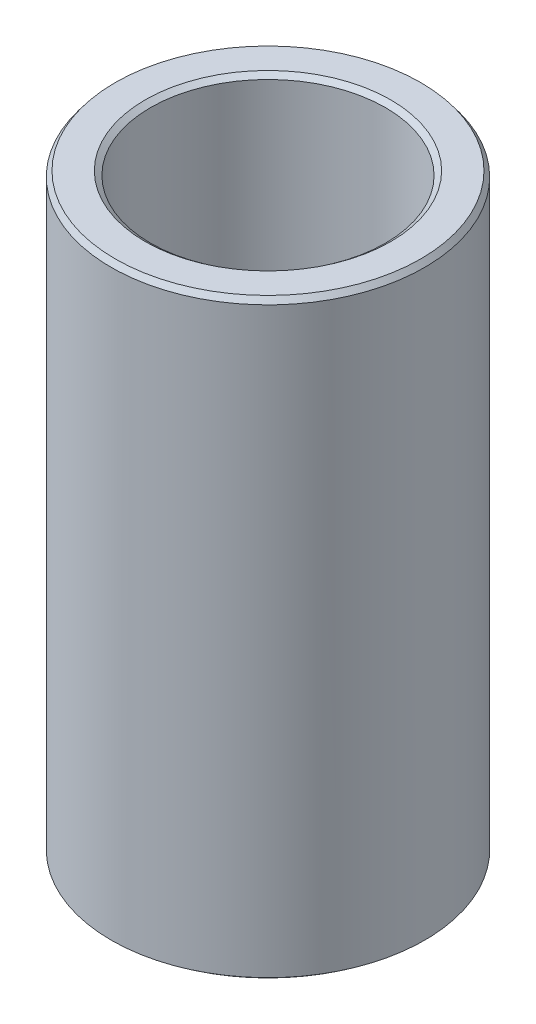
ISO-10303-21;
HEADER;
FILE_DESCRIPTION(('STEP AP214'),'2;1');
FILE_NAME('part.step','',(''),(''),'','','');
FILE_SCHEMA(('AUTOMOTIVE_DESIGN { 1 0 10303 214 1 1 1 1 }'));
ENDSEC;
DATA;
#1=APPLICATION_CONTEXT('core data for automotive mechanical design processes');
#2=APPLICATION_PROTOCOL_DEFINITION('international standard','automotive_design',2000,#1);
#3=PRODUCT_CONTEXT('',#1,'mechanical');
#4=PRODUCT('Part','Part','',(#3));
#5=PRODUCT_RELATED_PRODUCT_CATEGORY('part','',(#4));
#6=PRODUCT_DEFINITION_FORMATION('','',#4);
#7=PRODUCT_DEFINITION_CONTEXT('part definition',#1,'design');
#8=PRODUCT_DEFINITION('design','',#6,#7);
#9=PRODUCT_DEFINITION_SHAPE('','',#8);
#10=(LENGTH_UNIT() NAMED_UNIT(*) SI_UNIT(.MILLI.,.METRE.));
#11=(NAMED_UNIT(*) PLANE_ANGLE_UNIT() SI_UNIT($,.RADIAN.));
#12=(NAMED_UNIT(*) SI_UNIT($,.STERADIAN.) SOLID_ANGLE_UNIT());
#13=UNCERTAINTY_MEASURE_WITH_UNIT(LENGTH_MEASURE(1.E-05),#10,'distance_accuracy_value','');
#14=(GEOMETRIC_REPRESENTATION_CONTEXT(3) GLOBAL_UNCERTAINTY_ASSIGNED_CONTEXT((#13)) GLOBAL_UNIT_ASSIGNED_CONTEXT((#10,
#11,#12)) REPRESENTATION_CONTEXT('',''));
#15=CARTESIAN_POINT('',(0.,0.,0.));
#16=DIRECTION('',(0.,0.,1.));
#17=DIRECTION('',(1.,0.,0.));
#18=AXIS2_PLACEMENT_3D('',#15,#16,#17);
#19=CARTESIAN_POINT('',(0.,207.695562974438,0.));
#20=DIRECTION('',(0.,-1.,0.));
#21=DIRECTION('',(0.,0.,-1.));
#22=AXIS2_PLACEMENT_3D('',#19,#20,#21);
#23=CYLINDRICAL_SURFACE('',#22,55.);
#24=CARTESIAN_POINT('',(0.,1.41054314119912,0.));
#25=DIRECTION('',(0.,1.,0.));
#26=DIRECTION('',(0.,0.,1.));
#27=AXIS2_PLACEMENT_3D('',#24,#25,#26);
#28=CIRCLE('',#27,55.);
#29=CARTESIAN_POINT('',(0.,1.41054314119909,-55.));
#30=VERTEX_POINT('',#29);
#31=EDGE_CURVE('E10',#30,#30,#28,.T.);
#32=CARTESIAN_POINT('',(0.,205.822975685462,0.));
#33=DIRECTION('',(0.,1.,0.));
#34=DIRECTION('',(0.,0.,1.));
#35=AXIS2_PLACEMENT_3D('',#32,#33,#34);
#36=CIRCLE('',#35,55.);
#37=CARTESIAN_POINT('',(0.,205.822975685462,-55.));
#38=VERTEX_POINT('',#37);
#39=EDGE_CURVE('E50',#38,#38,#36,.F.);
#40=CARTESIAN_POINT('',(0.,1.41054314119909,-55.));
#41=CARTESIAN_POINT('',(0.,3.53983931353517,-55.));
#42=CARTESIAN_POINT('',(0.,5.66913548587124,-55.));
#43=CARTESIAN_POINT('',(0.,9.92772783054338,-55.));
#44=CARTESIAN_POINT('',(0.,12.0570240028794,-55.));
#45=CARTESIAN_POINT('',(0.,16.3156163475516,-55.));
#46=CARTESIAN_POINT('',(0.,18.4449125198877,-55.));
#47=CARTESIAN_POINT('',(0.,22.7035048645598,-55.));
#48=CARTESIAN_POINT('',(0.,24.8328010368959,-55.));
#49=CARTESIAN_POINT('',(0.,29.091393381568,-55.));
#50=CARTESIAN_POINT('',(0.,31.2206895539041,-55.));
#51=CARTESIAN_POINT('',(0.,35.4792818985762,-55.));
#52=CARTESIAN_POINT('',(0.,37.6085780709123,-55.));
#53=CARTESIAN_POINT('',(0.,41.8671704155844,-55.));
#54=CARTESIAN_POINT('',(0.,43.9964665879205,-55.));
#55=CARTESIAN_POINT('',(0.,48.2550589325926,-55.));
#56=CARTESIAN_POINT('',(0.,50.3843551049287,-55.));
#57=CARTESIAN_POINT('',(0.,54.6429474496008,-55.));
#58=CARTESIAN_POINT('',(0.,56.7722436219369,-55.));
#59=CARTESIAN_POINT('',(0.,61.0308359666091,-55.));
#60=CARTESIAN_POINT('',(0.,63.1601321389451,-55.));
#61=CARTESIAN_POINT('',(0.,67.4187244836173,-55.));
#62=CARTESIAN_POINT('',(0.,69.5480206559533,-55.));
#63=CARTESIAN_POINT('',(0.,73.8066130006255,-55.));
#64=CARTESIAN_POINT('',(0.,75.9359091729615,-55.));
#65=CARTESIAN_POINT('',(0.,80.1945015176337,-55.));
#66=CARTESIAN_POINT('',(0.,82.3237976899698,-55.));
#67=CARTESIAN_POINT('',(0.,86.5823900346419,-55.));
#68=CARTESIAN_POINT('',(0.,88.711686206978,-55.));
#69=CARTESIAN_POINT('',(0.,92.9702785516501,-55.));
#70=CARTESIAN_POINT('',(0.,95.0995747239862,-55.));
#71=CARTESIAN_POINT('',(0.,99.3581670686583,-55.));
#72=CARTESIAN_POINT('',(0.,101.487463240994,-55.));
#73=CARTESIAN_POINT('',(0.,105.746055585667,-55.));
#74=CARTESIAN_POINT('',(0.,107.875351758003,-55.));
#75=CARTESIAN_POINT('',(0.,112.133944102675,-55.));
#76=CARTESIAN_POINT('',(0.,114.263240275011,-55.));
#77=CARTESIAN_POINT('',(0.,118.521832619683,-55.));
#78=CARTESIAN_POINT('',(0.,120.651128792019,-55.));
#79=CARTESIAN_POINT('',(0.,124.909721136691,-55.));
#80=CARTESIAN_POINT('',(0.,127.039017309027,-55.));
#81=CARTESIAN_POINT('',(0.,131.297609653699,-55.));
#82=CARTESIAN_POINT('',(0.,133.426905826035,-55.));
#83=CARTESIAN_POINT('',(0.,137.685498170708,-55.));
#84=CARTESIAN_POINT('',(0.,139.814794343044,-55.));
#85=CARTESIAN_POINT('',(0.,144.073386687716,-55.));
#86=CARTESIAN_POINT('',(0.,146.202682860052,-55.));
#87=CARTESIAN_POINT('',(0.,150.461275204724,-55.));
#88=CARTESIAN_POINT('',(0.,152.59057137706,-55.));
#89=CARTESIAN_POINT('',(0.,156.849163721732,-55.));
#90=CARTESIAN_POINT('',(0.,158.978459894068,-55.));
#91=CARTESIAN_POINT('',(0.,163.23705223874,-55.));
#92=CARTESIAN_POINT('',(0.,165.366348411076,-55.));
#93=CARTESIAN_POINT('',(0.,169.624940755749,-55.));
#94=CARTESIAN_POINT('',(0.,171.754236928085,-55.));
#95=CARTESIAN_POINT('',(0.,176.012829272757,-55.));
#96=CARTESIAN_POINT('',(0.,178.142125445093,-55.));
#97=CARTESIAN_POINT('',(0.,182.400717789765,-55.));
#98=CARTESIAN_POINT('',(0.,184.530013962101,-55.));
#99=CARTESIAN_POINT('',(0.,188.788606306773,-55.));
#100=CARTESIAN_POINT('',(0.,190.917902479109,-55.));
#101=CARTESIAN_POINT('',(0.,195.176494823781,-55.));
#102=CARTESIAN_POINT('',(0.,197.305790996118,-55.));
#103=CARTESIAN_POINT('',(0.,201.56438334079,-55.));
#104=CARTESIAN_POINT('',(0.,203.693679513126,-55.));
#105=CARTESIAN_POINT('',(0.,205.822975685462,-55.));
#106=B_SPLINE_CURVE_WITH_KNOTS('',3,(#40,#41,#42,#43,#44,#45,#46,#47,#48,#49,#50,#51,#52,#53,
#54,#55,#56,#57,#58,#59,#60,#61,#62,#63,#64,#65,#66,#67,#68,#69,#70,#71,#72,#73,#74,#75,#76,#77,
#78,#79,#80,#81,#82,#83,#84,#85,#86,#87,#88,#89,#90,#91,#92,#93,#94,#95,#96,#97,#98,#99,#100,
#101,#102,#103,#104,#105),.UNSPECIFIED.,.F.,.F.,(4,2,2,2,2,2,2,2,2,2,2,2,2,2,2,2,2,2,2,2,2,2,2,
2,2,2,2,2,2,2,2,2,4),(0.,6.38788851700822,12.7757770340164,19.1636655510246,25.5515540680328,
31.9394425850411,38.3273311020493,44.7152196190575,51.1031081360657,57.4909966530739,
63.8788851700821,70.2667736870903,76.6546622040985,83.0425507211067,89.4304392381149,
95.8183277551231,102.206216272131,108.59410478914,114.981993306148,121.369881823156,
127.757770340164,134.145658857172,140.533547374181,146.921435891189,153.309324408197,
159.697212925205,166.085101442213,172.472989959222,178.86087847623,185.248766993238,
191.636655510246,198.024544027254,204.412432544263),.UNSPECIFIED.);
#107=EDGE_CURVE('BSEAM39',#30,#38,#106,.T.);
#108=ORIENTED_EDGE('',*,*,#31,.T.);
#109=ORIENTED_EDGE('',*,*,#39,.T.);
#110=ORIENTED_EDGE('',*,*,#107,.T.);
#111=ORIENTED_EDGE('',*,*,#107,.F.);
#112=EDGE_LOOP('',(#108,#110,#109,#111));
#113=FACE_BOUND('',#112,.T.);
#114=ADVANCED_FACE('F39',(#113),#23,.T.);
#115=CARTESIAN_POINT('',(0.,207.695562974438,0.));
#116=DIRECTION('',(0.,1.,0.));
#117=DIRECTION('',(0.,0.,1.));
#118=AXIS2_PLACEMENT_3D('',#115,#116,#117);
#119=PLANE('',#118);
#120=CARTESIAN_POINT('',(0.,207.695562974438,0.));
#121=DIRECTION('',(0.,1.,0.));
#122=DIRECTION('',(0.,0.,1.));
#123=AXIS2_PLACEMENT_3D('',#120,#121,#122);
#124=CIRCLE('',#123,43.0807212137916);
#125=CARTESIAN_POINT('',(0.,207.695562974438,43.0807212137916));
#126=VERTEX_POINT('',#125);
#127=EDGE_CURVE('E58',#126,#126,#124,.F.);
#128=ORIENTED_EDGE('',*,*,#127,.T.);
#129=EDGE_LOOP('',(#128));
#130=FACE_BOUND('',#129,.T.);
#131=CARTESIAN_POINT('',(0.,207.695562974438,0.));
#132=DIRECTION('',(0.,1.,0.));
#133=DIRECTION('',(0.,0.,1.));
#134=AXIS2_PLACEMENT_3D('',#131,#132,#133);
#135=CIRCLE('',#134,53.5894568588011);
#136=CARTESIAN_POINT('',(0.,207.695562974438,-53.5894568588012));
#137=VERTEX_POINT('',#136);
#138=EDGE_CURVE('E61',#137,#137,#135,.T.);
#139=ORIENTED_EDGE('',*,*,#138,.T.);
#140=EDGE_LOOP('',(#139));
#141=FACE_BOUND('',#140,.T.);
#142=ADVANCED_FACE('F88',(#130,#141),#119,.T.);
#143=CARTESIAN_POINT('',(0.,0.,0.));
#144=DIRECTION('',(0.,1.,0.));
#145=DIRECTION('',(0.,0.,1.));
#146=AXIS2_PLACEMENT_3D('',#143,#144,#145);
#147=PLANE('',#146);
#148=CARTESIAN_POINT('',(0.,0.,0.));
#149=DIRECTION('',(0.,1.,0.));
#150=DIRECTION('',(0.,0.,1.));
#151=AXIS2_PLACEMENT_3D('',#148,#149,#150);
#152=CIRCLE('',#151,42.6186770660138);
#153=CARTESIAN_POINT('',(0.,0.,-42.6186770660138));
#154=VERTEX_POINT('',#153);
#155=EDGE_CURVE('E51',#154,#154,#152,.T.);
#156=ORIENTED_EDGE('',*,*,#155,.T.);
#157=EDGE_LOOP('',(#156));
#158=FACE_BOUND('',#157,.T.);
#159=CARTESIAN_POINT('',(0.,0.,0.));
#160=DIRECTION('',(0.,1.,0.));
#161=DIRECTION('',(0.,0.,1.));
#162=AXIS2_PLACEMENT_3D('',#159,#160,#161);
#163=CIRCLE('',#162,53.1274127110232);
#164=CARTESIAN_POINT('',(0.,0.,53.1274127110232));
#165=VERTEX_POINT('',#164);
#166=EDGE_CURVE('E54',#165,#165,#163,.F.);
#167=ORIENTED_EDGE('',*,*,#166,.T.);
#168=EDGE_LOOP('',(#167));
#169=FACE_BOUND('',#168,.T.);
#170=ADVANCED_FACE('F83',(#158,#169),#147,.F.);
#171=CARTESIAN_POINT('',(0.,207.695562974438,0.));
#172=DIRECTION('',(0.,-1.,0.));
#173=DIRECTION('',(0.,0.,-1.));
#174=AXIS2_PLACEMENT_3D('',#171,#172,#173);
#175=CYLINDRICAL_SURFACE('',#174,41.2081339248149);
#176=CARTESIAN_POINT('',(0.,206.285019833239,0.));
#177=DIRECTION('',(0.,1.,0.));
#178=DIRECTION('',(0.,0.,1.));
#179=AXIS2_PLACEMENT_3D('',#176,#177,#178);
#180=CIRCLE('',#179,41.2081339248149);
#181=CARTESIAN_POINT('',(0.,206.285019833239,-41.2081339248149));
#182=VERTEX_POINT('',#181);
#183=EDGE_CURVE('E67',#182,#182,#180,.T.);
#184=CARTESIAN_POINT('',(0.,1.87258728897657,0.));
#185=DIRECTION('',(0.,1.,0.));
#186=DIRECTION('',(0.,0.,1.));
#187=AXIS2_PLACEMENT_3D('',#184,#185,#186);
#188=CIRCLE('',#187,41.2081339248149);
#189=CARTESIAN_POINT('',(0.,1.87258728897655,-41.2081339248149));
#190=VERTEX_POINT('',#189);
#191=EDGE_CURVE('E69',#190,#190,#188,.F.);
#192=CARTESIAN_POINT('',(0.,206.285019833239,-41.2081339248149));
#193=CARTESIAN_POINT('',(0.,204.155723660903,-41.2081339248149));
#194=CARTESIAN_POINT('',(0.,202.026427488567,-41.2081339248149));
#195=CARTESIAN_POINT('',(0.,197.767835143895,-41.2081339248149));
#196=CARTESIAN_POINT('',(0.,195.638538971559,-41.2081339248149));
#197=CARTESIAN_POINT('',(0.,191.379946626887,-41.2081339248149));
#198=CARTESIAN_POINT('',(0.,189.25065045455,-41.2081339248149));
#199=CARTESIAN_POINT('',(0.,184.992058109878,-41.2081339248149));
#200=CARTESIAN_POINT('',(0.,182.862761937542,-41.2081339248149));
#201=CARTESIAN_POINT('',(0.,178.60416959287,-41.2081339248149));
#202=CARTESIAN_POINT('',(0.,176.474873420534,-41.2081339248149));
#203=CARTESIAN_POINT('',(0.,172.216281075862,-41.2081339248149));
#204=CARTESIAN_POINT('',(0.,170.086984903526,-41.2081339248149));
#205=CARTESIAN_POINT('',(0.,165.828392558854,-41.2081339248149));
#206=CARTESIAN_POINT('',(0.,163.699096386518,-41.2081339248149));
#207=CARTESIAN_POINT('',(0.,159.440504041846,-41.2081339248149));
#208=CARTESIAN_POINT('',(0.,157.311207869509,-41.2081339248149));
#209=CARTESIAN_POINT('',(0.,153.052615524837,-41.2081339248149));
#210=CARTESIAN_POINT('',(0.,150.923319352501,-41.2081339248149));
#211=CARTESIAN_POINT('',(0.,146.664727007829,-41.2081339248149));
#212=CARTESIAN_POINT('',(0.,144.535430835493,-41.2081339248149));
#213=CARTESIAN_POINT('',(0.,140.276838490821,-41.2081339248149));
#214=CARTESIAN_POINT('',(0.,138.147542318485,-41.2081339248149));
#215=CARTESIAN_POINT('',(0.,133.888949973813,-41.2081339248149));
#216=CARTESIAN_POINT('',(0.,131.759653801477,-41.2081339248149));
#217=CARTESIAN_POINT('',(0.,127.501061456805,-41.2081339248149));
#218=CARTESIAN_POINT('',(0.,125.371765284468,-41.2081339248149));
#219=CARTESIAN_POINT('',(0.,121.113172939796,-41.2081339248149));
#220=CARTESIAN_POINT('',(0.,118.98387676746,-41.2081339248149));
#221=CARTESIAN_POINT('',(0.,114.725284422788,-41.2081339248149));
#222=CARTESIAN_POINT('',(0.,112.595988250452,-41.2081339248149));
#223=CARTESIAN_POINT('',(0.,108.33739590578,-41.2081339248149));
#224=CARTESIAN_POINT('',(0.,106.208099733444,-41.2081339248149));
#225=CARTESIAN_POINT('',(0.,101.949507388772,-41.2081339248149));
#226=CARTESIAN_POINT('',(0.,99.8202112164356,-41.2081339248149));
#227=CARTESIAN_POINT('',(0.,95.5616188717635,-41.2081339248149));
#228=CARTESIAN_POINT('',(0.,93.4323226994274,-41.2081339248149));
#229=CARTESIAN_POINT('',(0.,89.1737303547553,-41.2081339248149));
#230=CARTESIAN_POINT('',(0.,87.0444341824192,-41.2081339248149));
#231=CARTESIAN_POINT('',(0.,82.7858418377471,-41.2081339248149));
#232=CARTESIAN_POINT('',(0.,80.656545665411,-41.2081339248149));
#233=CARTESIAN_POINT('',(0.,76.3979533207389,-41.2081339248149));
#234=CARTESIAN_POINT('',(0.,74.2686571484029,-41.2081339248149));
#235=CARTESIAN_POINT('',(0.,70.0100648037307,-41.2081339248149));
#236=CARTESIAN_POINT('',(0.,67.8807686313946,-41.2081339248149));
#237=CARTESIAN_POINT('',(0.,63.6221762867225,-41.2081339248149));
#238=CARTESIAN_POINT('',(0.,61.4928801143864,-41.2081339248149));
#239=CARTESIAN_POINT('',(0.,57.2342877697143,-41.2081339248149));
#240=CARTESIAN_POINT('',(0.,55.1049915973782,-41.2081339248149));
#241=CARTESIAN_POINT('',(0.,50.8463992527061,-41.2081339248149));
#242=CARTESIAN_POINT('',(0.,48.71710308037,-41.2081339248149));
#243=CARTESIAN_POINT('',(0.,44.4585107356979,-41.2081339248149));
#244=CARTESIAN_POINT('',(0.,42.3292145633618,-41.2081339248149));
#245=CARTESIAN_POINT('',(0.,38.0706222186897,-41.2081339248149));
#246=CARTESIAN_POINT('',(0.,35.9413260463536,-41.2081339248149));
#247=CARTESIAN_POINT('',(0.,31.6827337016815,-41.2081339248149));
#248=CARTESIAN_POINT('',(0.,29.5534375293454,-41.2081339248149));
#249=CARTESIAN_POINT('',(0.,25.2948451846733,-41.2081339248149));
#250=CARTESIAN_POINT('',(0.,23.1655490123372,-41.2081339248149));
#251=CARTESIAN_POINT('',(0.,18.9069566676651,-41.2081339248149));
#252=CARTESIAN_POINT('',(0.,16.777660495329,-41.2081339248149));
#253=CARTESIAN_POINT('',(0.,12.5190681506569,-41.2081339248149));
#254=CARTESIAN_POINT('',(0.,10.3897719783208,-41.2081339248149));
#255=CARTESIAN_POINT('',(0.,6.13117963364866,-41.2081339248149));
#256=CARTESIAN_POINT('',(0.,4.0018834613126,-41.2081339248149));
#257=CARTESIAN_POINT('',(0.,1.87258728897655,-41.2081339248149));
#258=B_SPLINE_CURVE_WITH_KNOTS('',3,(#192,#193,#194,#195,#196,#197,#198,#199,#200,#201,#202,
#203,#204,#205,#206,#207,#208,#209,#210,#211,#212,#213,#214,#215,#216,#217,#218,#219,#220,#221,
#222,#223,#224,#225,#226,#227,#228,#229,#230,#231,#232,#233,#234,#235,#236,#237,#238,#239,#240,
#241,#242,#243,#244,#245,#246,#247,#248,#249,#250,#251,#252,#253,#254,#255,#256,#257),
.UNSPECIFIED.,.F.,.F.,(4,2,2,2,2,2,2,2,2,2,2,2,2,2,2,2,2,2,2,2,2,2,2,2,2,2,2,2,2,2,2,2,4),(0.,
6.38788851700822,12.7757770340164,19.1636655510246,25.5515540680328,31.939442585041,
38.3273311020492,44.7152196190574,51.1031081360656,57.4909966530738,63.878885170082,
70.2667736870903,76.6546622040984,83.0425507211066,89.4304392381148,95.818327755123,
102.206216272131,108.594104789139,114.981993306148,121.369881823156,127.757770340164,
134.145658857172,140.53354737418,146.921435891189,153.309324408197,159.697212925205,
166.085101442213,172.472989959221,178.86087847623,185.248766993238,191.636655510246,
198.024544027254,204.412432544262),.UNSPECIFIED.);
#259=EDGE_CURVE('BSEAM71',#182,#190,#258,.T.);
#260=ORIENTED_EDGE('',*,*,#183,.T.);
#261=ORIENTED_EDGE('',*,*,#191,.T.);
#262=ORIENTED_EDGE('',*,*,#259,.T.);
#263=ORIENTED_EDGE('',*,*,#259,.F.);
#264=EDGE_LOOP('',(#260,#262,#261,#263));
#265=FACE_BOUND('',#264,.T.);
#266=ADVANCED_FACE('F71',(#265),#175,.F.);
#267=CARTESIAN_POINT('',(0.,206.285019833239,0.));
#268=DIRECTION('',(0.,1.,0.));
#269=DIRECTION('',(0.,0.,1.));
#270=AXIS2_PLACEMENT_3D('',#267,#268,#269);
#271=CONICAL_SURFACE('',#270,41.2081339248149,0.925212748526552);
#272=ORIENTED_EDGE('',*,*,#127,.F.);
#273=EDGE_LOOP('',(#272));
#274=FACE_BOUND('',#273,.T.);
#275=ORIENTED_EDGE('',*,*,#183,.F.);
#276=EDGE_LOOP('',(#275));
#277=FACE_BOUND('',#276,.T.);
#278=ADVANCED_FACE('F77',(#274,#277),#271,.F.);
#279=CARTESIAN_POINT('',(0.,0.,0.));
#280=DIRECTION('',(0.,-1.,0.));
#281=DIRECTION('',(0.,0.,-1.));
#282=AXIS2_PLACEMENT_3D('',#279,#280,#281);
#283=CONICAL_SURFACE('',#282,42.6186770660138,0.645583578268345);
#284=CARTESIAN_POINT('',(0.,1.87258728897657,-41.2081339248149));
#285=CARTESIAN_POINT('',(0.,1.85308117138307,-41.2228270825357));
#286=CARTESIAN_POINT('',(0.,1.83357505378956,-41.2375202402565));
#287=CARTESIAN_POINT('',(0.,1.79456281860255,-41.2669065556981));
#288=CARTESIAN_POINT('',(0.,1.77505670100904,-41.281599713419));
#289=CARTESIAN_POINT('',(0.,1.73604446582203,-41.3109860288606));
#290=CARTESIAN_POINT('',(0.,1.71653834822853,-41.3256791865814));
#291=CARTESIAN_POINT('',(0.,1.67752611304151,-41.3550655020231));
#292=CARTESIAN_POINT('',(0.,1.65801999544801,-41.3697586597439));
#293=CARTESIAN_POINT('',(0.,1.619007760261,-41.3991449751855));
#294=CARTESIAN_POINT('',(0.,1.59950164266749,-41.4138381329064));
#295=CARTESIAN_POINT('',(0.,1.56048940748048,-41.443224448348));
#296=CARTESIAN_POINT('',(0.,1.54098328988697,-41.4579176060688));
#297=CARTESIAN_POINT('',(0.,1.50197105469996,-41.4873039215105));
#298=CARTESIAN_POINT('',(0.,1.48246493710645,-41.5019970792313));
#299=CARTESIAN_POINT('',(0.,1.44345270191944,-41.531383394673));
#300=CARTESIAN_POINT('',(0.,1.42394658432594,-41.5460765523938));
#301=CARTESIAN_POINT('',(0.,1.38493434913892,-41.5754628678354));
#302=CARTESIAN_POINT('',(0.,1.36542823154542,-41.5901560255562));
#303=CARTESIAN_POINT('',(0.,1.32641599635841,-41.6195423409979));
#304=CARTESIAN_POINT('',(0.,1.3069098787649,-41.6342354987187));
#305=CARTESIAN_POINT('',(0.,1.26789764357789,-41.6636218141604));
#306=CARTESIAN_POINT('',(0.,1.24839152598438,-41.6783149718812));
#307=CARTESIAN_POINT('',(0.,1.20937929079737,-41.7077012873228));
#308=CARTESIAN_POINT('',(0.,1.18987317320386,-41.7223944450436));
#309=CARTESIAN_POINT('',(0.,1.15086093801685,-41.7517807604853));
#310=CARTESIAN_POINT('',(0.,1.13135482042335,-41.7664739182061));
#311=CARTESIAN_POINT('',(0.,1.09234258523633,-41.7958602336478));
#312=CARTESIAN_POINT('',(0.,1.07283646764283,-41.8105533913686));
#313=CARTESIAN_POINT('',(0.,1.03382423245582,-41.8399397068102));
#314=CARTESIAN_POINT('',(0.,1.01431811486231,-41.8546328645311));
#315=CARTESIAN_POINT('',(0.,0.975305879675299,-41.8840191799727));
#316=CARTESIAN_POINT('',(0.,0.955799762081793,-41.8987123376935));
#317=CARTESIAN_POINT('',(0.,0.916787526894781,-41.9280986531352));
#318=CARTESIAN_POINT('',(0.,0.897281409301275,-41.942791810856));
#319=CARTESIAN_POINT('',(0.,0.858269174114263,-41.9721781262976));
#320=CARTESIAN_POINT('',(0.,0.838763056520758,-41.9868712840185));
#321=CARTESIAN_POINT('',(0.,0.799750821333745,-42.0162575994601));
#322=CARTESIAN_POINT('',(0.,0.780244703740239,-42.0309507571809));
#323=CARTESIAN_POINT('',(0.,0.741232468553226,-42.0603370726226));
#324=CARTESIAN_POINT('',(0.,0.721726350959721,-42.0750302303434));
#325=CARTESIAN_POINT('',(0.,0.682714115772709,-42.104416545785));
#326=CARTESIAN_POINT('',(0.,0.663207998179203,-42.1191097035059));
#327=CARTESIAN_POINT('',(0.,0.624195762992191,-42.1484960189475));
#328=CARTESIAN_POINT('',(0.,0.604689645398685,-42.1631891766683));
#329=CARTESIAN_POINT('',(0.,0.565677410211673,-42.19257549211));
#330=CARTESIAN_POINT('',(0.,0.546171292618168,-42.2072686498308));
#331=CARTESIAN_POINT('',(0.,0.507159057431156,-42.2366549652725));
#332=CARTESIAN_POINT('',(0.,0.487652939837649,-42.2513481229933));
#333=CARTESIAN_POINT('',(0.,0.448640704650637,-42.2807344384349));
#334=CARTESIAN_POINT('',(0.,0.429134587057131,-42.2954275961557));
#335=CARTESIAN_POINT('',(0.,0.39012235187012,-42.3248139115974));
#336=CARTESIAN_POINT('',(0.,0.370616234276614,-42.3395070693182));
#337=CARTESIAN_POINT('',(0.,0.331603999089601,-42.3688933847599));
#338=CARTESIAN_POINT('',(0.,0.312097881496096,-42.3835865424807));
#339=CARTESIAN_POINT('',(0.,0.273085646309084,-42.4129728579223));
#340=CARTESIAN_POINT('',(0.,0.253579528715577,-42.4276660156431));
#341=CARTESIAN_POINT('',(0.,0.214567293528566,-42.4570523310848));
#342=CARTESIAN_POINT('',(0.,0.19506117593506,-42.4717454888056));
#343=CARTESIAN_POINT('',(0.,0.156048940748048,-42.5011318042473));
#344=CARTESIAN_POINT('',(0.,0.136542823154541,-42.5158249619681));
#345=CARTESIAN_POINT('',(0.,0.0975305879675291,-42.5452112774097));
#346=CARTESIAN_POINT('',(0.,0.0780244703740235,-42.5599044351306));
#347=CARTESIAN_POINT('',(0.,0.0390122351870123,-42.5892907505722));
#348=CARTESIAN_POINT('',(0.,0.0195061175935067,-42.603983908293));
#349=CARTESIAN_POINT('',(0.,0.,-42.6186770660138));
#350=B_SPLINE_CURVE_WITH_KNOTS('',3,(#284,#285,#286,#287,#288,#289,#290,#291,#292,#293,#294,
#295,#296,#297,#298,#299,#300,#301,#302,#303,#304,#305,#306,#307,#308,#309,#310,#311,#312,#313,
#314,#315,#316,#317,#318,#319,#320,#321,#322,#323,#324,#325,#326,#327,#328,#329,#330,#331,#332,
#333,#334,#335,#336,#337,#338,#339,#340,#341,#342,#343,#344,#345,#346,#347,#348,#349),
.UNSPECIFIED.,.F.,.F.,(4,2,2,2,2,2,2,2,2,2,2,2,2,2,2,2,2,2,2,2,2,2,2,2,2,2,2,2,2,2,2,2,4),(0.,
0.0732625249798699,0.14652504995974,0.219787574939606,0.293050099919475,0.366312624899345,
0.439575149879215,0.512837674859085,0.586100199838955,0.659362724818821,0.732625249798691,
0.80588777477856,0.87915029975843,0.9524128247383,1.02567534971817,1.09893787469804,
1.17220039967791,1.24546292465778,1.31872544963765,1.39198797461751,1.46525049959738,
1.53851302457725,1.61177554955712,1.68503807453699,1.75830059951686,1.83156312449673,
1.9048256494766,1.97808817445647,2.05135069943634,2.12461322441621,2.19787574939607,
2.27113827437594,2.34440079935581),.UNSPECIFIED.);
#351=EDGE_CURVE('BSEAM73',#190,#154,#350,.T.);
#352=ORIENTED_EDGE('',*,*,#191,.F.);
#353=ORIENTED_EDGE('',*,*,#155,.F.);
#354=ORIENTED_EDGE('',*,*,#351,.T.);
#355=ORIENTED_EDGE('',*,*,#351,.F.);
#356=EDGE_LOOP('',(#352,#354,#353,#355));
#357=FACE_BOUND('',#356,.T.);
#358=ADVANCED_FACE('F73',(#357),#283,.F.);
#359=CARTESIAN_POINT('',(0.,1.41054314119912,0.));
#360=DIRECTION('',(0.,1.,0.));
#361=DIRECTION('',(0.,0.,1.));
#362=AXIS2_PLACEMENT_3D('',#359,#360,#361);
#363=CONICAL_SURFACE('',#362,55.,0.925212748526555);
#364=ORIENTED_EDGE('',*,*,#166,.F.);
#365=EDGE_LOOP('',(#364));
#366=FACE_BOUND('',#365,.T.);
#367=ORIENTED_EDGE('',*,*,#31,.F.);
#368=EDGE_LOOP('',(#367));
#369=FACE_BOUND('',#368,.T.);
#370=ADVANCED_FACE('F76',(#366,#369),#363,.T.);
#371=CARTESIAN_POINT('',(0.,207.695562974438,0.));
#372=DIRECTION('',(0.,-1.,0.));
#373=DIRECTION('',(0.,0.,-1.));
#374=AXIS2_PLACEMENT_3D('',#371,#372,#373);
#375=CONICAL_SURFACE('',#374,53.5894568588011,0.645583578268355);
#376=CARTESIAN_POINT('',(0.,205.822975685462,-55.));
#377=CARTESIAN_POINT('',(0.,205.842481803055,-54.9853068422792));
#378=CARTESIAN_POINT('',(0.,205.861987920649,-54.9706136845584));
#379=CARTESIAN_POINT('',(0.,205.901000155836,-54.9412273691167));
#380=CARTESIAN_POINT('',(0.,205.920506273429,-54.9265342113959));
#381=CARTESIAN_POINT('',(0.,205.959518508616,-54.8971478959543));
#382=CARTESIAN_POINT('',(0.,205.97902462621,-54.8824547382334));
#383=CARTESIAN_POINT('',(0.,206.018036861397,-54.8530684227918));
#384=CARTESIAN_POINT('',(0.,206.03754297899,-54.838375265071));
#385=CARTESIAN_POINT('',(0.,206.076555214177,-54.8089889496293));
#386=CARTESIAN_POINT('',(0.,206.096061331771,-54.7942957919085));
#387=CARTESIAN_POINT('',(0.,206.135073566958,-54.7649094764669));
#388=CARTESIAN_POINT('',(0.,206.154579684551,-54.750216318746));
#389=CARTESIAN_POINT('',(0.,206.193591919738,-54.7208300033044));
#390=CARTESIAN_POINT('',(0.,206.213098037332,-54.7061368455836));
#391=CARTESIAN_POINT('',(0.,206.252110272519,-54.6767505301419));
#392=CARTESIAN_POINT('',(0.,206.271616390112,-54.6620573724211));
#393=CARTESIAN_POINT('',(0.,206.310628625299,-54.6326710569795));
#394=CARTESIAN_POINT('',(0.,206.330134742893,-54.6179778992587));
#395=CARTESIAN_POINT('',(0.,206.36914697808,-54.588591583817));
#396=CARTESIAN_POINT('',(0.,206.388653095673,-54.5738984260962));
#397=CARTESIAN_POINT('',(0.,206.42766533086,-54.5445121106545));
#398=CARTESIAN_POINT('',(0.,206.447171448454,-54.5298189529337));
#399=CARTESIAN_POINT('',(0.,206.486183683641,-54.5004326374921));
#400=CARTESIAN_POINT('',(0.,206.505689801234,-54.4857394797713));
#401=CARTESIAN_POINT('',(0.,206.544702036421,-54.4563531643296));
#402=CARTESIAN_POINT('',(0.,206.564208154015,-54.4416600066088));
#403=CARTESIAN_POINT('',(0.,206.603220389202,-54.4122736911672));
#404=CARTESIAN_POINT('',(0.,206.622726506795,-54.3975805334463));
#405=CARTESIAN_POINT('',(0.,206.661738741982,-54.3681942180047));
#406=CARTESIAN_POINT('',(0.,206.681244859576,-54.3535010602839));
#407=CARTESIAN_POINT('',(0.,206.720257094763,-54.3241147448422));
#408=CARTESIAN_POINT('',(0.,206.739763212356,-54.3094215871214));
#409=CARTESIAN_POINT('',(0.,206.778775447543,-54.2800352716798));
#410=CARTESIAN_POINT('',(0.,206.798281565137,-54.2653421139589));
#411=CARTESIAN_POINT('',(0.,206.837293800324,-54.2359557985173));
#412=CARTESIAN_POINT('',(0.,206.856799917917,-54.2212626407965));
#413=CARTESIAN_POINT('',(0.,206.895812153104,-54.1918763253548));
#414=CARTESIAN_POINT('',(0.,206.915318270698,-54.177183167634));
#415=CARTESIAN_POINT('',(0.,206.954330505885,-54.1477968521924));
#416=CARTESIAN_POINT('',(0.,206.973836623479,-54.1331036944716));
#417=CARTESIAN_POINT('',(0.,207.012848858666,-54.1037173790299));
#418=CARTESIAN_POINT('',(0.,207.032354976259,-54.0890242213091));
#419=CARTESIAN_POINT('',(0.,207.071367211446,-54.0596379058674));
#420=CARTESIAN_POINT('',(0.,207.09087332904,-54.0449447481466));
#421=CARTESIAN_POINT('',(0.,207.129885564227,-54.015558432705));
#422=CARTESIAN_POINT('',(0.,207.14939168182,-54.0008652749842));
#423=CARTESIAN_POINT('',(0.,207.188403917007,-53.9714789595425));
#424=CARTESIAN_POINT('',(0.,207.207910034601,-53.9567858018217));
#425=CARTESIAN_POINT('',(0.,207.246922269788,-53.92739948638));
#426=CARTESIAN_POINT('',(0.,207.266428387381,-53.9127063286592));
#427=CARTESIAN_POINT('',(0.,207.305440622568,-53.8833200132176));
#428=CARTESIAN_POINT('',(0.,207.324946740162,-53.8686268554968));
#429=CARTESIAN_POINT('',(0.,207.363958975349,-53.8392405400551));
#430=CARTESIAN_POINT('',(0.,207.383465092942,-53.8245473823343));
#431=CARTESIAN_POINT('',(0.,207.422477328129,-53.7951610668926));
#432=CARTESIAN_POINT('',(0.,207.441983445723,-53.7804679091718));
#433=CARTESIAN_POINT('',(0.,207.48099568091,-53.7510815937302));
#434=CARTESIAN_POINT('',(0.,207.500501798503,-53.7363884360094));
#435=CARTESIAN_POINT('',(0.,207.53951403369,-53.7070021205677));
#436=CARTESIAN_POINT('',(0.,207.559020151284,-53.6923089628469));
#437=CARTESIAN_POINT('',(0.,207.598032386471,-53.6629226474053));
#438=CARTESIAN_POINT('',(0.,207.617538504064,-53.6482294896844));
#439=CARTESIAN_POINT('',(0.,207.656550739251,-53.6188431742428));
#440=CARTESIAN_POINT('',(0.,207.676056856845,-53.604150016522));
#441=CARTESIAN_POINT('',(0.,207.695562974438,-53.5894568588012));
#442=B_SPLINE_CURVE_WITH_KNOTS('',3,(#376,#377,#378,#379,#380,#381,#382,#383,#384,#385,#386,
#387,#388,#389,#390,#391,#392,#393,#394,#395,#396,#397,#398,#399,#400,#401,#402,#403,#404,#405,
#406,#407,#408,#409,#410,#411,#412,#413,#414,#415,#416,#417,#418,#419,#420,#421,#422,#423,#424,
#425,#426,#427,#428,#429,#430,#431,#432,#433,#434,#435,#436,#437,#438,#439,#440,#441),
.UNSPECIFIED.,.F.,.F.,(4,2,2,2,2,2,2,2,2,2,2,2,2,2,2,2,2,2,2,2,2,2,2,2,2,2,2,2,2,2,2,2,4),(0.,
0.0732625249798831,0.14652504995974,0.219787574939596,0.293050099919453,0.36631262489931,
0.439575149879171,0.51283767485905,0.586100199838906,0.659362724818763,0.73262524979862,
0.805887774778481,0.879150299758337,0.952412824738216,1.02567534971807,1.09893787469793,
1.17220039967779,1.24546292465765,1.3187254496375,1.39198797461736,1.46525049959724,
1.5385130245771,1.61177554955696,1.68503807453681,1.75830059951667,1.83156312449653,
1.90482564947641,1.97808817445627,2.05135069943612,2.12461322441598,2.19787574939584,
2.27113827437569,2.34440079935557),.UNSPECIFIED.);
#443=EDGE_CURVE('BSEAM45',#38,#137,#442,.T.);
#444=ORIENTED_EDGE('',*,*,#39,.F.);
#445=ORIENTED_EDGE('',*,*,#138,.F.);
#446=ORIENTED_EDGE('',*,*,#443,.T.);
#447=ORIENTED_EDGE('',*,*,#443,.F.);
#448=EDGE_LOOP('',(#444,#446,#445,#447));
#449=FACE_BOUND('',#448,.T.);
#450=ADVANCED_FACE('F45',(#449),#375,.T.);
#451=CLOSED_SHELL('',(#114,#142,#170,#266,#278,#358,#370,#450));
#452=MANIFOLD_SOLID_BREP('B2',#451);
#453=ADVANCED_BREP_SHAPE_REPRESENTATION('',(#18,#452),#14);
#454=SHAPE_DEFINITION_REPRESENTATION(#9,#453);
ENDSEC;
END-ISO-10303-21;
